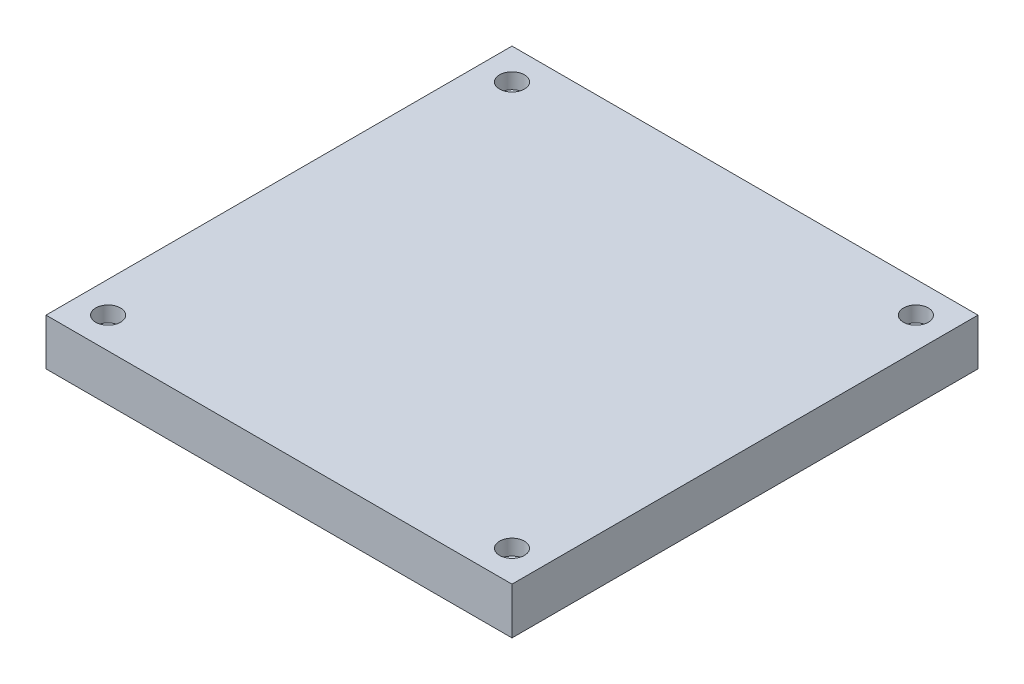
ISO-10303-21;
HEADER;
FILE_DESCRIPTION(('STEP AP214'),'2;1');
FILE_NAME('part.step','',(''),(''),'','','');
FILE_SCHEMA(('AUTOMOTIVE_DESIGN { 1 0 10303 214 1 1 1 1 }'));
ENDSEC;
DATA;
#1=APPLICATION_CONTEXT('core data for automotive mechanical design processes');
#2=APPLICATION_PROTOCOL_DEFINITION('international standard','automotive_design',2000,#1);
#3=PRODUCT_CONTEXT('',#1,'mechanical');
#4=PRODUCT('Part','Part','',(#3));
#5=PRODUCT_RELATED_PRODUCT_CATEGORY('part','',(#4));
#6=PRODUCT_DEFINITION_FORMATION('','',#4);
#7=PRODUCT_DEFINITION_CONTEXT('part definition',#1,'design');
#8=PRODUCT_DEFINITION('design','',#6,#7);
#9=PRODUCT_DEFINITION_SHAPE('','',#8);
#10=(LENGTH_UNIT() NAMED_UNIT(*) SI_UNIT(.MILLI.,.METRE.));
#11=(NAMED_UNIT(*) PLANE_ANGLE_UNIT() SI_UNIT($,.RADIAN.));
#12=(NAMED_UNIT(*) SI_UNIT($,.STERADIAN.) SOLID_ANGLE_UNIT());
#13=UNCERTAINTY_MEASURE_WITH_UNIT(LENGTH_MEASURE(1.E-05),#10,'distance_accuracy_value','');
#14=(GEOMETRIC_REPRESENTATION_CONTEXT(3) GLOBAL_UNCERTAINTY_ASSIGNED_CONTEXT((#13)) GLOBAL_UNIT_ASSIGNED_CONTEXT((#10,
#11,#12)) REPRESENTATION_CONTEXT('',''));
#15=CARTESIAN_POINT('',(0.,0.,0.));
#16=DIRECTION('',(0.,0.,1.));
#17=DIRECTION('',(1.,0.,0.));
#18=AXIS2_PLACEMENT_3D('',#15,#16,#17);
#19=CARTESIAN_POINT('',(150.,30.,150.));
#20=DIRECTION('',(-1.,0.,0.));
#21=DIRECTION('',(0.,0.,1.));
#22=AXIS2_PLACEMENT_3D('',#19,#20,#21);
#23=PLANE('',#22);
#24=DIRECTION('',(0.,0.,-1.));
#25=VECTOR('',#24,1.);
#26=CARTESIAN_POINT('',(150.,0.,150.));
#27=LINE('',#26,#25);
#28=CARTESIAN_POINT('',(150.,0.,150.));
#29=VERTEX_POINT('',#28);
#30=CARTESIAN_POINT('',(150.,0.,-150.));
#31=VERTEX_POINT('',#30);
#32=EDGE_CURVE('E166',#29,#31,#27,.T.);
#33=ORIENTED_EDGE('',*,*,#32,.T.);
#34=DIRECTION('',(0.,-1.,0.));
#35=VECTOR('',#34,1.);
#36=CARTESIAN_POINT('',(150.,30.,-150.));
#37=LINE('',#36,#35);
#38=CARTESIAN_POINT('',(150.,30.,-150.));
#39=VERTEX_POINT('',#38);
#40=EDGE_CURVE('E11',#39,#31,#37,.T.);
#41=ORIENTED_EDGE('',*,*,#40,.F.);
#42=DIRECTION('',(0.,0.,-1.));
#43=VECTOR('',#42,1.);
#44=CARTESIAN_POINT('',(150.,30.,150.));
#45=LINE('',#44,#43);
#46=CARTESIAN_POINT('',(150.,30.,150.));
#47=VERTEX_POINT('',#46);
#48=EDGE_CURVE('E167',#47,#39,#45,.T.);
#49=ORIENTED_EDGE('',*,*,#48,.F.);
#50=DIRECTION('',(0.,-1.,0.));
#51=VECTOR('',#50,1.);
#52=CARTESIAN_POINT('',(150.,30.,150.));
#53=LINE('',#52,#51);
#54=EDGE_CURVE('E173',#47,#29,#53,.T.);
#55=ORIENTED_EDGE('',*,*,#54,.T.);
#56=EDGE_LOOP('',(#33,#41,#49,#55));
#57=FACE_BOUND('',#56,.T.);
#58=ADVANCED_FACE('F37',(#57),#23,.F.);
#59=CARTESIAN_POINT('',(-150.,30.,-150.));
#60=DIRECTION('',(0.,0.,1.));
#61=DIRECTION('',(1.,0.,0.));
#62=AXIS2_PLACEMENT_3D('',#59,#60,#61);
#63=PLANE('',#62);
#64=DIRECTION('',(-1.,0.,0.));
#65=VECTOR('',#64,1.);
#66=CARTESIAN_POINT('',(-150.,0.,-150.));
#67=LINE('',#66,#65);
#68=CARTESIAN_POINT('',(-150.,0.,-150.));
#69=VERTEX_POINT('',#68);
#70=EDGE_CURVE('E176',#31,#69,#67,.T.);
#71=ORIENTED_EDGE('',*,*,#70,.T.);
#72=DIRECTION('',(0.,-1.,0.));
#73=VECTOR('',#72,1.);
#74=CARTESIAN_POINT('',(-150.,30.,-150.));
#75=LINE('',#74,#73);
#76=CARTESIAN_POINT('',(-150.,30.,-150.));
#77=VERTEX_POINT('',#76);
#78=EDGE_CURVE('E45',#77,#69,#75,.T.);
#79=ORIENTED_EDGE('',*,*,#78,.F.);
#80=DIRECTION('',(-1.,0.,0.));
#81=VECTOR('',#80,1.);
#82=CARTESIAN_POINT('',(-150.,30.,-150.));
#83=LINE('',#82,#81);
#84=EDGE_CURVE('E84',#39,#77,#83,.T.);
#85=ORIENTED_EDGE('',*,*,#84,.F.);
#86=ORIENTED_EDGE('',*,*,#40,.T.);
#87=EDGE_LOOP('',(#71,#79,#85,#86));
#88=FACE_BOUND('',#87,.T.);
#89=ADVANCED_FACE('F200',(#88),#63,.F.);
#90=CARTESIAN_POINT('',(-150.,30.,150.));
#91=DIRECTION('',(1.,0.,0.));
#92=DIRECTION('',(0.,0.,-1.));
#93=AXIS2_PLACEMENT_3D('',#90,#91,#92);
#94=PLANE('',#93);
#95=DIRECTION('',(0.,0.,1.));
#96=VECTOR('',#95,1.);
#97=CARTESIAN_POINT('',(-150.,0.,150.));
#98=LINE('',#97,#96);
#99=CARTESIAN_POINT('',(-150.,0.,150.));
#100=VERTEX_POINT('',#99);
#101=EDGE_CURVE('E71',#69,#100,#98,.T.);
#102=ORIENTED_EDGE('',*,*,#101,.T.);
#103=DIRECTION('',(0.,-1.,0.));
#104=VECTOR('',#103,1.);
#105=CARTESIAN_POINT('',(-150.,30.,150.));
#106=LINE('',#105,#104);
#107=CARTESIAN_POINT('',(-150.,30.,150.));
#108=VERTEX_POINT('',#107);
#109=EDGE_CURVE('E181',#108,#100,#106,.T.);
#110=ORIENTED_EDGE('',*,*,#109,.F.);
#111=DIRECTION('',(0.,0.,1.));
#112=VECTOR('',#111,1.);
#113=CARTESIAN_POINT('',(-150.,30.,150.));
#114=LINE('',#113,#112);
#115=EDGE_CURVE('E170',#77,#108,#114,.T.);
#116=ORIENTED_EDGE('',*,*,#115,.F.);
#117=ORIENTED_EDGE('',*,*,#78,.T.);
#118=EDGE_LOOP('',(#102,#110,#116,#117));
#119=FACE_BOUND('',#118,.T.);
#120=ADVANCED_FACE('F183',(#119),#94,.F.);
#121=CARTESIAN_POINT('',(-150.,30.,150.));
#122=DIRECTION('',(0.,0.,-1.));
#123=DIRECTION('',(-1.,0.,0.));
#124=AXIS2_PLACEMENT_3D('',#121,#122,#123);
#125=PLANE('',#124);
#126=DIRECTION('',(1.,0.,0.));
#127=VECTOR('',#126,1.);
#128=CARTESIAN_POINT('',(-150.,0.,150.));
#129=LINE('',#128,#127);
#130=EDGE_CURVE('E77',#100,#29,#129,.T.);
#131=ORIENTED_EDGE('',*,*,#130,.T.);
#132=ORIENTED_EDGE('',*,*,#54,.F.);
#133=DIRECTION('',(1.,0.,0.));
#134=VECTOR('',#133,1.);
#135=CARTESIAN_POINT('',(-150.,30.,150.));
#136=LINE('',#135,#134);
#137=EDGE_CURVE('E53',#108,#47,#136,.T.);
#138=ORIENTED_EDGE('',*,*,#137,.F.);
#139=ORIENTED_EDGE('',*,*,#109,.T.);
#140=EDGE_LOOP('',(#131,#132,#138,#139));
#141=FACE_BOUND('',#140,.T.);
#142=ADVANCED_FACE('F190',(#141),#125,.F.);
#143=CARTESIAN_POINT('',(0.,30.,0.));
#144=DIRECTION('',(0.,-1.,0.));
#145=DIRECTION('',(0.,0.,-1.));
#146=AXIS2_PLACEMENT_3D('',#143,#144,#145);
#147=PLANE('',#146);
#148=CARTESIAN_POINT('',(-130.,30.,-130.));
#149=DIRECTION('',(0.,1.,0.));
#150=DIRECTION('',(0.,0.,1.));
#151=AXIS2_PLACEMENT_3D('',#148,#149,#150);
#152=CIRCLE('',#151,7.99999999999999);
#153=CARTESIAN_POINT('',(-130.,30.,-122.));
#154=VERTEX_POINT('',#153);
#155=EDGE_CURVE('E120',#154,#154,#152,.T.);
#156=ORIENTED_EDGE('',*,*,#155,.F.);
#157=EDGE_LOOP('',(#156));
#158=FACE_BOUND('',#157,.T.);
#159=CARTESIAN_POINT('',(130.,30.,-130.));
#160=DIRECTION('',(0.,1.,0.));
#161=DIRECTION('',(0.,0.,1.));
#162=AXIS2_PLACEMENT_3D('',#159,#160,#161);
#163=CIRCLE('',#162,8.00000000000001);
#164=CARTESIAN_POINT('',(130.,30.,-122.));
#165=VERTEX_POINT('',#164);
#166=EDGE_CURVE('E119',#165,#165,#163,.T.);
#167=ORIENTED_EDGE('',*,*,#166,.F.);
#168=EDGE_LOOP('',(#167));
#169=FACE_BOUND('',#168,.T.);
#170=CARTESIAN_POINT('',(130.,30.,130.));
#171=DIRECTION('',(0.,1.,0.));
#172=DIRECTION('',(0.,0.,1.));
#173=AXIS2_PLACEMENT_3D('',#170,#171,#172);
#174=CIRCLE('',#173,8.00000000000001);
#175=CARTESIAN_POINT('',(130.,30.,138.));
#176=VERTEX_POINT('',#175);
#177=EDGE_CURVE('E130',#176,#176,#174,.T.);
#178=ORIENTED_EDGE('',*,*,#177,.F.);
#179=EDGE_LOOP('',(#178));
#180=FACE_BOUND('',#179,.T.);
#181=CARTESIAN_POINT('',(-130.,30.,130.));
#182=DIRECTION('',(0.,1.,0.));
#183=DIRECTION('',(0.,0.,1.));
#184=AXIS2_PLACEMENT_3D('',#181,#182,#183);
#185=CIRCLE('',#184,7.99999999999999);
#186=CARTESIAN_POINT('',(-130.,30.,138.));
#187=VERTEX_POINT('',#186);
#188=EDGE_CURVE('E136',#187,#187,#185,.T.);
#189=ORIENTED_EDGE('',*,*,#188,.F.);
#190=EDGE_LOOP('',(#189));
#191=FACE_BOUND('',#190,.T.);
#192=ORIENTED_EDGE('',*,*,#48,.T.);
#193=ORIENTED_EDGE('',*,*,#84,.T.);
#194=ORIENTED_EDGE('',*,*,#115,.T.);
#195=ORIENTED_EDGE('',*,*,#137,.T.);
#196=EDGE_LOOP('',(#192,#193,#194,#195));
#197=FACE_BOUND('',#196,.T.);
#198=ADVANCED_FACE('F192',(#158,#169,#180,#191,#197),#147,.F.);
#199=CARTESIAN_POINT('',(0.,0.,0.));
#200=DIRECTION('',(0.,-1.,0.));
#201=DIRECTION('',(0.,0.,-1.));
#202=AXIS2_PLACEMENT_3D('',#199,#200,#201);
#203=PLANE('',#202);
#204=CARTESIAN_POINT('',(-55.,0.,71.));
#205=DIRECTION('',(0.,-1.,0.));
#206=DIRECTION('',(0.,0.,-1.));
#207=AXIS2_PLACEMENT_3D('',#204,#205,#206);
#208=CIRCLE('',#207,7.);
#209=CARTESIAN_POINT('',(-55.,0.,64.));
#210=VERTEX_POINT('',#209);
#211=EDGE_CURVE('E142',#210,#210,#208,.T.);
#212=ORIENTED_EDGE('',*,*,#211,.F.);
#213=EDGE_LOOP('',(#212));
#214=FACE_BOUND('',#213,.T.);
#215=CARTESIAN_POINT('',(55.,0.,71.));
#216=DIRECTION('',(0.,-1.,0.));
#217=DIRECTION('',(0.,0.,-1.));
#218=AXIS2_PLACEMENT_3D('',#215,#216,#217);
#219=CIRCLE('',#218,7.);
#220=CARTESIAN_POINT('',(55.,0.,64.));
#221=VERTEX_POINT('',#220);
#222=EDGE_CURVE('E148',#221,#221,#219,.T.);
#223=ORIENTED_EDGE('',*,*,#222,.F.);
#224=EDGE_LOOP('',(#223));
#225=FACE_BOUND('',#224,.T.);
#226=CARTESIAN_POINT('',(55.,0.,-71.));
#227=DIRECTION('',(0.,-1.,0.));
#228=DIRECTION('',(0.,0.,-1.));
#229=AXIS2_PLACEMENT_3D('',#226,#227,#228);
#230=CIRCLE('',#229,7.);
#231=CARTESIAN_POINT('',(55.,0.,-78.));
#232=VERTEX_POINT('',#231);
#233=EDGE_CURVE('E154',#232,#232,#230,.T.);
#234=ORIENTED_EDGE('',*,*,#233,.F.);
#235=EDGE_LOOP('',(#234));
#236=FACE_BOUND('',#235,.T.);
#237=CARTESIAN_POINT('',(-55.,0.,-71.));
#238=DIRECTION('',(0.,-1.,0.));
#239=DIRECTION('',(0.,0.,-1.));
#240=AXIS2_PLACEMENT_3D('',#237,#238,#239);
#241=CIRCLE('',#240,7.);
#242=CARTESIAN_POINT('',(-55.,0.,-78.));
#243=VERTEX_POINT('',#242);
#244=EDGE_CURVE('E160',#243,#243,#241,.T.);
#245=ORIENTED_EDGE('',*,*,#244,.F.);
#246=EDGE_LOOP('',(#245));
#247=FACE_BOUND('',#246,.T.);
#248=ORIENTED_EDGE('',*,*,#32,.F.);
#249=ORIENTED_EDGE('',*,*,#130,.F.);
#250=ORIENTED_EDGE('',*,*,#101,.F.);
#251=ORIENTED_EDGE('',*,*,#70,.F.);
#252=EDGE_LOOP('',(#248,#249,#250,#251));
#253=FACE_BOUND('',#252,.T.);
#254=ADVANCED_FACE('F186',(#214,#225,#236,#247,#253),#203,.T.);
#255=CARTESIAN_POINT('',(-55.,10.,-71.));
#256=DIRECTION('',(0.,-1.,0.));
#257=DIRECTION('',(0.,0.,-1.));
#258=AXIS2_PLACEMENT_3D('',#255,#256,#257);
#259=CONICAL_SURFACE('',#258,7.,1.02974425867665);
#260=CARTESIAN_POINT('',(-55.,14.2060243331929,-71.));
#261=VERTEX_POINT('',#260);
#262=VERTEX_LOOP('',#261);
#263=FACE_BOUND('',#262,.T.);
#264=CARTESIAN_POINT('',(-55.,10.,-71.));
#265=DIRECTION('',(0.,-1.,0.));
#266=DIRECTION('',(0.,0.,-1.));
#267=AXIS2_PLACEMENT_3D('',#264,#265,#266);
#268=CIRCLE('',#267,7.);
#269=CARTESIAN_POINT('',(-55.,10.,-78.));
#270=VERTEX_POINT('',#269);
#271=EDGE_CURVE('E163',#270,#270,#268,.T.);
#272=ORIENTED_EDGE('',*,*,#271,.T.);
#273=EDGE_LOOP('',(#272));
#274=FACE_BOUND('',#273,.T.);
#275=ADVANCED_FACE('F227',(#263,#274),#259,.F.);
#276=CARTESIAN_POINT('',(-55.,0.,-71.));
#277=DIRECTION('',(0.,-1.,0.));
#278=DIRECTION('',(0.,0.,-1.));
#279=AXIS2_PLACEMENT_3D('',#276,#277,#278);
#280=CYLINDRICAL_SURFACE('',#279,7.);
#281=ORIENTED_EDGE('',*,*,#271,.F.);
#282=EDGE_LOOP('',(#281));
#283=FACE_BOUND('',#282,.T.);
#284=ORIENTED_EDGE('',*,*,#244,.T.);
#285=EDGE_LOOP('',(#284));
#286=FACE_BOUND('',#285,.T.);
#287=ADVANCED_FACE('F236',(#283,#286),#280,.F.);
#288=CARTESIAN_POINT('',(55.,10.,-71.));
#289=DIRECTION('',(0.,-1.,0.));
#290=DIRECTION('',(0.,0.,-1.));
#291=AXIS2_PLACEMENT_3D('',#288,#289,#290);
#292=CONICAL_SURFACE('',#291,7.,1.02974425867665);
#293=CARTESIAN_POINT('',(55.,14.2060243331929,-71.));
#294=VERTEX_POINT('',#293);
#295=VERTEX_LOOP('',#294);
#296=FACE_BOUND('',#295,.T.);
#297=CARTESIAN_POINT('',(55.,10.,-71.));
#298=DIRECTION('',(0.,-1.,0.));
#299=DIRECTION('',(0.,0.,-1.));
#300=AXIS2_PLACEMENT_3D('',#297,#298,#299);
#301=CIRCLE('',#300,7.);
#302=CARTESIAN_POINT('',(55.,10.,-78.));
#303=VERTEX_POINT('',#302);
#304=EDGE_CURVE('E157',#303,#303,#301,.T.);
#305=ORIENTED_EDGE('',*,*,#304,.T.);
#306=EDGE_LOOP('',(#305));
#307=FACE_BOUND('',#306,.T.);
#308=ADVANCED_FACE('F247',(#296,#307),#292,.F.);
#309=CARTESIAN_POINT('',(55.,0.,-71.));
#310=DIRECTION('',(0.,-1.,0.));
#311=DIRECTION('',(0.,0.,-1.));
#312=AXIS2_PLACEMENT_3D('',#309,#310,#311);
#313=CYLINDRICAL_SURFACE('',#312,7.);
#314=ORIENTED_EDGE('',*,*,#304,.F.);
#315=EDGE_LOOP('',(#314));
#316=FACE_BOUND('',#315,.T.);
#317=ORIENTED_EDGE('',*,*,#233,.T.);
#318=EDGE_LOOP('',(#317));
#319=FACE_BOUND('',#318,.T.);
#320=ADVANCED_FACE('F260',(#316,#319),#313,.F.);
#321=CARTESIAN_POINT('',(55.,10.,71.));
#322=DIRECTION('',(0.,-1.,0.));
#323=DIRECTION('',(0.,0.,-1.));
#324=AXIS2_PLACEMENT_3D('',#321,#322,#323);
#325=CONICAL_SURFACE('',#324,7.,1.02974425867665);
#326=CARTESIAN_POINT('',(55.,14.2060243331929,71.));
#327=VERTEX_POINT('',#326);
#328=VERTEX_LOOP('',#327);
#329=FACE_BOUND('',#328,.T.);
#330=CARTESIAN_POINT('',(55.,10.,71.));
#331=DIRECTION('',(0.,-1.,0.));
#332=DIRECTION('',(0.,0.,-1.));
#333=AXIS2_PLACEMENT_3D('',#330,#331,#332);
#334=CIRCLE('',#333,7.);
#335=CARTESIAN_POINT('',(55.,10.,64.));
#336=VERTEX_POINT('',#335);
#337=EDGE_CURVE('E151',#336,#336,#334,.T.);
#338=ORIENTED_EDGE('',*,*,#337,.T.);
#339=EDGE_LOOP('',(#338));
#340=FACE_BOUND('',#339,.T.);
#341=ADVANCED_FACE('F270',(#329,#340),#325,.F.);
#342=CARTESIAN_POINT('',(55.,0.,71.));
#343=DIRECTION('',(0.,-1.,0.));
#344=DIRECTION('',(0.,0.,-1.));
#345=AXIS2_PLACEMENT_3D('',#342,#343,#344);
#346=CYLINDRICAL_SURFACE('',#345,7.);
#347=ORIENTED_EDGE('',*,*,#337,.F.);
#348=EDGE_LOOP('',(#347));
#349=FACE_BOUND('',#348,.T.);
#350=ORIENTED_EDGE('',*,*,#222,.T.);
#351=EDGE_LOOP('',(#350));
#352=FACE_BOUND('',#351,.T.);
#353=ADVANCED_FACE('F282',(#349,#352),#346,.F.);
#354=CARTESIAN_POINT('',(-55.,10.,71.));
#355=DIRECTION('',(0.,-1.,0.));
#356=DIRECTION('',(0.,0.,-1.));
#357=AXIS2_PLACEMENT_3D('',#354,#355,#356);
#358=CONICAL_SURFACE('',#357,7.,1.02974425867665);
#359=CARTESIAN_POINT('',(-55.,14.2060243331929,71.));
#360=VERTEX_POINT('',#359);
#361=VERTEX_LOOP('',#360);
#362=FACE_BOUND('',#361,.T.);
#363=CARTESIAN_POINT('',(-55.,10.,71.));
#364=DIRECTION('',(0.,-1.,0.));
#365=DIRECTION('',(0.,0.,-1.));
#366=AXIS2_PLACEMENT_3D('',#363,#364,#365);
#367=CIRCLE('',#366,7.);
#368=CARTESIAN_POINT('',(-55.,10.,64.));
#369=VERTEX_POINT('',#368);
#370=EDGE_CURVE('E145',#369,#369,#367,.T.);
#371=ORIENTED_EDGE('',*,*,#370,.T.);
#372=EDGE_LOOP('',(#371));
#373=FACE_BOUND('',#372,.T.);
#374=ADVANCED_FACE('F292',(#362,#373),#358,.F.);
#375=CARTESIAN_POINT('',(-55.,0.,71.));
#376=DIRECTION('',(0.,-1.,0.));
#377=DIRECTION('',(0.,0.,-1.));
#378=AXIS2_PLACEMENT_3D('',#375,#376,#377);
#379=CYLINDRICAL_SURFACE('',#378,7.);
#380=ORIENTED_EDGE('',*,*,#370,.F.);
#381=EDGE_LOOP('',(#380));
#382=FACE_BOUND('',#381,.T.);
#383=ORIENTED_EDGE('',*,*,#211,.T.);
#384=EDGE_LOOP('',(#383));
#385=FACE_BOUND('',#384,.T.);
#386=ADVANCED_FACE('F304',(#382,#385),#379,.F.);
#387=CARTESIAN_POINT('',(-130.,20.,130.));
#388=DIRECTION('',(0.,1.,0.));
#389=DIRECTION('',(0.,0.,1.));
#390=AXIS2_PLACEMENT_3D('',#387,#388,#389);
#391=CONICAL_SURFACE('',#390,7.99999999999999,1.02974425867665);
#392=CARTESIAN_POINT('',(-130.,15.1931150477795,130.));
#393=VERTEX_POINT('',#392);
#394=VERTEX_LOOP('',#393);
#395=FACE_BOUND('',#394,.T.);
#396=CARTESIAN_POINT('',(-130.,20.,130.));
#397=DIRECTION('',(0.,1.,0.));
#398=DIRECTION('',(0.,0.,1.));
#399=AXIS2_PLACEMENT_3D('',#396,#397,#398);
#400=CIRCLE('',#399,7.99999999999999);
#401=CARTESIAN_POINT('',(-130.,20.,138.));
#402=VERTEX_POINT('',#401);
#403=EDGE_CURVE('E139',#402,#402,#400,.T.);
#404=ORIENTED_EDGE('',*,*,#403,.T.);
#405=EDGE_LOOP('',(#404));
#406=FACE_BOUND('',#405,.T.);
#407=ADVANCED_FACE('F314',(#395,#406),#391,.F.);
#408=CARTESIAN_POINT('',(-130.,30.,130.));
#409=DIRECTION('',(0.,1.,0.));
#410=DIRECTION('',(0.,0.,1.));
#411=AXIS2_PLACEMENT_3D('',#408,#409,#410);
#412=CYLINDRICAL_SURFACE('',#411,7.99999999999999);
#413=ORIENTED_EDGE('',*,*,#403,.F.);
#414=EDGE_LOOP('',(#413));
#415=FACE_BOUND('',#414,.T.);
#416=ORIENTED_EDGE('',*,*,#188,.T.);
#417=EDGE_LOOP('',(#416));
#418=FACE_BOUND('',#417,.T.);
#419=ADVANCED_FACE('F330',(#415,#418),#412,.F.);
#420=CARTESIAN_POINT('',(130.,20.,130.));
#421=DIRECTION('',(0.,1.,0.));
#422=DIRECTION('',(0.,0.,1.));
#423=AXIS2_PLACEMENT_3D('',#420,#421,#422);
#424=CONICAL_SURFACE('',#423,8.00000000000001,1.02974425867665);
#425=CARTESIAN_POINT('',(130.,15.1931150477795,130.));
#426=VERTEX_POINT('',#425);
#427=VERTEX_LOOP('',#426);
#428=FACE_BOUND('',#427,.T.);
#429=CARTESIAN_POINT('',(130.,20.,130.));
#430=DIRECTION('',(0.,1.,0.));
#431=DIRECTION('',(0.,0.,1.));
#432=AXIS2_PLACEMENT_3D('',#429,#430,#431);
#433=CIRCLE('',#432,8.00000000000001);
#434=CARTESIAN_POINT('',(130.,20.,138.));
#435=VERTEX_POINT('',#434);
#436=EDGE_CURVE('E133',#435,#435,#433,.T.);
#437=ORIENTED_EDGE('',*,*,#436,.T.);
#438=EDGE_LOOP('',(#437));
#439=FACE_BOUND('',#438,.T.);
#440=ADVANCED_FACE('F341',(#428,#439),#424,.F.);
#441=CARTESIAN_POINT('',(130.,30.,130.));
#442=DIRECTION('',(0.,1.,0.));
#443=DIRECTION('',(0.,0.,1.));
#444=AXIS2_PLACEMENT_3D('',#441,#442,#443);
#445=CYLINDRICAL_SURFACE('',#444,8.00000000000001);
#446=ORIENTED_EDGE('',*,*,#436,.F.);
#447=EDGE_LOOP('',(#446));
#448=FACE_BOUND('',#447,.T.);
#449=ORIENTED_EDGE('',*,*,#177,.T.);
#450=EDGE_LOOP('',(#449));
#451=FACE_BOUND('',#450,.T.);
#452=ADVANCED_FACE('F352',(#448,#451),#445,.F.);
#453=CARTESIAN_POINT('',(130.,20.,-130.));
#454=DIRECTION('',(0.,1.,0.));
#455=DIRECTION('',(0.,0.,1.));
#456=AXIS2_PLACEMENT_3D('',#453,#454,#455);
#457=CONICAL_SURFACE('',#456,8.00000000000001,1.02974425867665);
#458=CARTESIAN_POINT('',(130.,15.1931150477795,-130.));
#459=VERTEX_POINT('',#458);
#460=VERTEX_LOOP('',#459);
#461=FACE_BOUND('',#460,.T.);
#462=CARTESIAN_POINT('',(130.,20.,-130.));
#463=DIRECTION('',(0.,1.,0.));
#464=DIRECTION('',(0.,0.,1.));
#465=AXIS2_PLACEMENT_3D('',#462,#463,#464);
#466=CIRCLE('',#465,8.00000000000001);
#467=CARTESIAN_POINT('',(130.,20.,-122.));
#468=VERTEX_POINT('',#467);
#469=EDGE_CURVE('E123',#468,#468,#466,.T.);
#470=ORIENTED_EDGE('',*,*,#469,.T.);
#471=EDGE_LOOP('',(#470));
#472=FACE_BOUND('',#471,.T.);
#473=ADVANCED_FACE('F362',(#461,#472),#457,.F.);
#474=CARTESIAN_POINT('',(130.,30.,-130.));
#475=DIRECTION('',(0.,1.,0.));
#476=DIRECTION('',(0.,0.,1.));
#477=AXIS2_PLACEMENT_3D('',#474,#475,#476);
#478=CYLINDRICAL_SURFACE('',#477,8.00000000000001);
#479=ORIENTED_EDGE('',*,*,#469,.F.);
#480=EDGE_LOOP('',(#479));
#481=FACE_BOUND('',#480,.T.);
#482=ORIENTED_EDGE('',*,*,#166,.T.);
#483=EDGE_LOOP('',(#482));
#484=FACE_BOUND('',#483,.T.);
#485=ADVANCED_FACE('F113',(#481,#484),#478,.F.);
#486=CARTESIAN_POINT('',(-130.,20.,-130.));
#487=DIRECTION('',(0.,1.,0.));
#488=DIRECTION('',(0.,0.,1.));
#489=AXIS2_PLACEMENT_3D('',#486,#487,#488);
#490=CONICAL_SURFACE('',#489,7.99999999999999,1.02974425867665);
#491=CARTESIAN_POINT('',(-130.,15.1931150477795,-130.));
#492=VERTEX_POINT('',#491);
#493=VERTEX_LOOP('',#492);
#494=FACE_BOUND('',#493,.T.);
#495=CARTESIAN_POINT('',(-130.,20.,-130.));
#496=DIRECTION('',(0.,1.,0.));
#497=DIRECTION('',(0.,0.,1.));
#498=AXIS2_PLACEMENT_3D('',#495,#496,#497);
#499=CIRCLE('',#498,7.99999999999999);
#500=CARTESIAN_POINT('',(-130.,20.,-122.));
#501=VERTEX_POINT('',#500);
#502=EDGE_CURVE('E117',#501,#501,#499,.T.);
#503=ORIENTED_EDGE('',*,*,#502,.T.);
#504=EDGE_LOOP('',(#503));
#505=FACE_BOUND('',#504,.T.);
#506=ADVANCED_FACE('F109',(#494,#505),#490,.F.);
#507=CARTESIAN_POINT('',(-130.,30.,-130.));
#508=DIRECTION('',(0.,1.,0.));
#509=DIRECTION('',(0.,0.,1.));
#510=AXIS2_PLACEMENT_3D('',#507,#508,#509);
#511=CYLINDRICAL_SURFACE('',#510,7.99999999999999);
#512=ORIENTED_EDGE('',*,*,#502,.F.);
#513=EDGE_LOOP('',(#512));
#514=FACE_BOUND('',#513,.T.);
#515=ORIENTED_EDGE('',*,*,#155,.T.);
#516=EDGE_LOOP('',(#515));
#517=FACE_BOUND('',#516,.T.);
#518=ADVANCED_FACE('F112',(#514,#517),#511,.F.);
#519=CLOSED_SHELL('',(#58,#89,#120,#142,#198,#254,#275,#287,#308,#320,#341,#353,#374,#386,#407,
#419,#440,#452,#473,#485,#506,#518));
#520=MANIFOLD_SOLID_BREP('B2',#519);
#521=ADVANCED_BREP_SHAPE_REPRESENTATION('',(#18,#520),#14);
#522=SHAPE_DEFINITION_REPRESENTATION(#9,#521);
ENDSEC;
END-ISO-10303-21;
